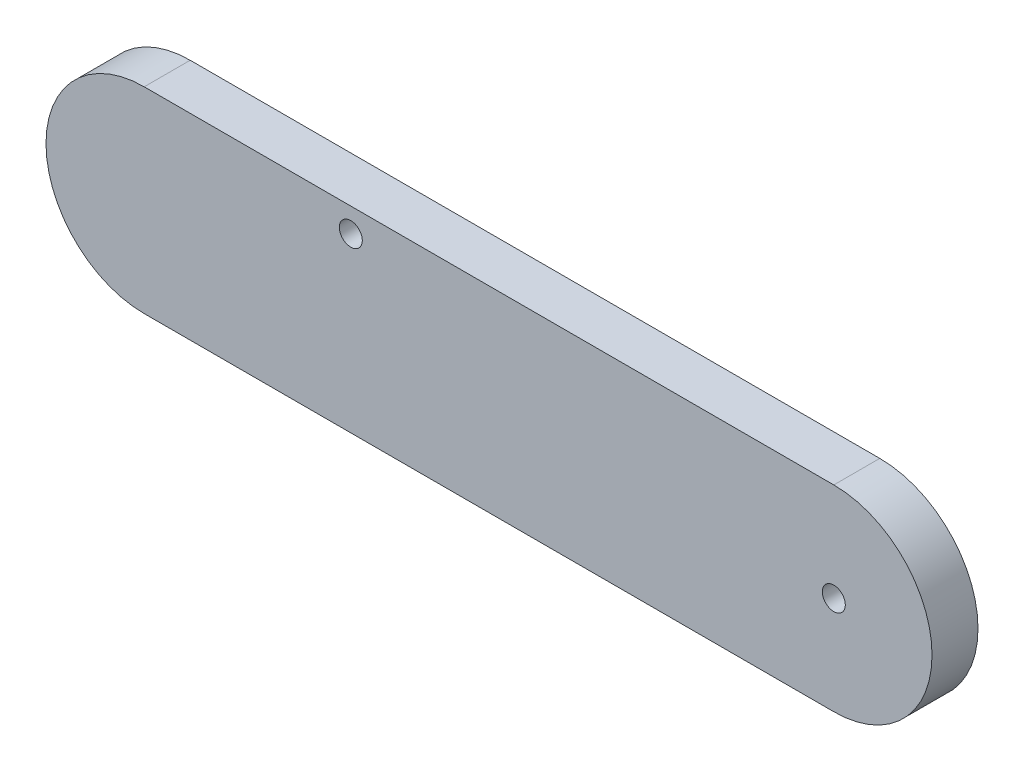
ISO-10303-21;
HEADER;
FILE_DESCRIPTION(('STEP AP214'),'2;1');
FILE_NAME('part.step','',(''),(''),'','','');
FILE_SCHEMA(('AUTOMOTIVE_DESIGN { 1 0 10303 214 1 1 1 1 }'));
ENDSEC;
DATA;
#1=APPLICATION_CONTEXT('core data for automotive mechanical design processes');
#2=APPLICATION_PROTOCOL_DEFINITION('international standard','automotive_design',2000,#1);
#3=PRODUCT_CONTEXT('',#1,'mechanical');
#4=PRODUCT('Part','Part','',(#3));
#5=PRODUCT_RELATED_PRODUCT_CATEGORY('part','',(#4));
#6=PRODUCT_DEFINITION_FORMATION('','',#4);
#7=PRODUCT_DEFINITION_CONTEXT('part definition',#1,'design');
#8=PRODUCT_DEFINITION('design','',#6,#7);
#9=PRODUCT_DEFINITION_SHAPE('','',#8);
#10=(LENGTH_UNIT() NAMED_UNIT(*) SI_UNIT(.MILLI.,.METRE.));
#11=(NAMED_UNIT(*) PLANE_ANGLE_UNIT() SI_UNIT($,.RADIAN.));
#12=(NAMED_UNIT(*) SI_UNIT($,.STERADIAN.) SOLID_ANGLE_UNIT());
#13=UNCERTAINTY_MEASURE_WITH_UNIT(LENGTH_MEASURE(1.E-05),#10,'distance_accuracy_value','');
#14=(GEOMETRIC_REPRESENTATION_CONTEXT(3) GLOBAL_UNCERTAINTY_ASSIGNED_CONTEXT((#13)) GLOBAL_UNIT_ASSIGNED_CONTEXT((#10,
#11,#12)) REPRESENTATION_CONTEXT('',''));
#15=CARTESIAN_POINT('',(0.,0.,0.));
#16=DIRECTION('',(0.,0.,1.));
#17=DIRECTION('',(1.,0.,0.));
#18=AXIS2_PLACEMENT_3D('',#15,#16,#17);
#19=CARTESIAN_POINT('',(-78.3382789317508,0.,10.));
#20=DIRECTION('',(0.,0.,1.));
#21=DIRECTION('',(1.,0.,0.));
#22=AXIS2_PLACEMENT_3D('',#19,#20,#21);
#23=PLANE('',#22);
#24=CARTESIAN_POINT('',(71.6617210682492,0.,10.));
#25=DIRECTION('',(0.,0.,1.));
#26=DIRECTION('',(1.,0.,0.));
#27=AXIS2_PLACEMENT_3D('',#24,#25,#26);
#28=CIRCLE('',#27,2.5);
#29=CARTESIAN_POINT('',(74.1617210682492,0.,10.));
#30=VERTEX_POINT('',#29);
#31=EDGE_CURVE('E113',#30,#30,#28,.T.);
#32=ORIENTED_EDGE('',*,*,#31,.F.);
#33=EDGE_LOOP('',(#32));
#34=FACE_BOUND('',#33,.T.);
#35=CARTESIAN_POINT('',(-78.3382789317508,0.,10.));
#36=DIRECTION('',(0.,0.,1.));
#37=DIRECTION('',(1.,0.,0.));
#38=AXIS2_PLACEMENT_3D('',#35,#36,#37);
#39=CIRCLE('',#38,21.3649851632047);
#40=CARTESIAN_POINT('',(-78.3382789317508,21.3649851632047,10.));
#41=VERTEX_POINT('',#40);
#42=CARTESIAN_POINT('',(-78.3382789317508,-21.3649851632047,10.));
#43=VERTEX_POINT('',#42);
#44=EDGE_CURVE('E89',#41,#43,#39,.T.);
#45=ORIENTED_EDGE('',*,*,#44,.T.);
#46=DIRECTION('',(1.,0.,0.));
#47=VECTOR('',#46,1.);
#48=CARTESIAN_POINT('',(-78.3382789317508,-21.3649851632047,10.));
#49=LINE('',#48,#47);
#50=CARTESIAN_POINT('',(71.6617210682492,-21.3649851632047,10.));
#51=VERTEX_POINT('',#50);
#52=EDGE_CURVE('E84',#43,#51,#49,.T.);
#53=ORIENTED_EDGE('',*,*,#52,.T.);
#54=CARTESIAN_POINT('',(71.6617210682492,0.,10.));
#55=DIRECTION('',(0.,0.,1.));
#56=DIRECTION('',(1.,0.,0.));
#57=AXIS2_PLACEMENT_3D('',#54,#55,#56);
#58=CIRCLE('',#57,21.3649851632047);
#59=CARTESIAN_POINT('',(71.6617210682492,21.3649851632047,10.));
#60=VERTEX_POINT('',#59);
#61=EDGE_CURVE('E87',#51,#60,#58,.T.);
#62=ORIENTED_EDGE('',*,*,#61,.T.);
#63=DIRECTION('',(-1.,0.,0.));
#64=VECTOR('',#63,1.);
#65=CARTESIAN_POINT('',(-78.3382789317508,21.3649851632047,10.));
#66=LINE('',#65,#64);
#67=EDGE_CURVE('E54',#60,#41,#66,.T.);
#68=ORIENTED_EDGE('',*,*,#67,.T.);
#69=EDGE_LOOP('',(#45,#53,#62,#68));
#70=FACE_BOUND('',#69,.T.);
#71=CARTESIAN_POINT('',(-33.4027695878032,16.1249851632047,10.));
#72=DIRECTION('',(0.,0.,1.));
#73=DIRECTION('',(1.,0.,0.));
#74=AXIS2_PLACEMENT_3D('',#71,#72,#73);
#75=CIRCLE('',#74,2.5);
#76=CARTESIAN_POINT('',(-30.9027695878032,16.1249851632047,10.));
#77=VERTEX_POINT('',#76);
#78=EDGE_CURVE('E114',#77,#77,#75,.T.);
#79=ORIENTED_EDGE('',*,*,#78,.F.);
#80=EDGE_LOOP('',(#79));
#81=FACE_BOUND('',#80,.T.);
#82=ADVANCED_FACE('F37',(#34,#70,#81),#23,.T.);
#83=CARTESIAN_POINT('',(-78.3382789317508,0.,0.));
#84=DIRECTION('',(0.,0.,1.));
#85=DIRECTION('',(1.,0.,0.));
#86=AXIS2_PLACEMENT_3D('',#83,#84,#85);
#87=PLANE('',#86);
#88=CARTESIAN_POINT('',(-78.3382789317508,0.,0.));
#89=DIRECTION('',(0.,0.,1.));
#90=DIRECTION('',(1.,0.,0.));
#91=AXIS2_PLACEMENT_3D('',#88,#89,#90);
#92=CIRCLE('',#91,21.3649851632047);
#93=CARTESIAN_POINT('',(-78.3382789317508,21.3649851632047,0.));
#94=VERTEX_POINT('',#93);
#95=CARTESIAN_POINT('',(-78.3382789317508,-21.3649851632047,0.));
#96=VERTEX_POINT('',#95);
#97=EDGE_CURVE('E118',#94,#96,#92,.T.);
#98=ORIENTED_EDGE('',*,*,#97,.F.);
#99=DIRECTION('',(-1.,0.,0.));
#100=VECTOR('',#99,1.);
#101=CARTESIAN_POINT('',(-78.3382789317508,21.3649851632047,0.));
#102=LINE('',#101,#100);
#103=CARTESIAN_POINT('',(71.6617210682492,21.3649851632047,0.));
#104=VERTEX_POINT('',#103);
#105=EDGE_CURVE('E77',#104,#94,#102,.T.);
#106=ORIENTED_EDGE('',*,*,#105,.F.);
#107=CARTESIAN_POINT('',(71.6617210682492,0.,0.));
#108=DIRECTION('',(0.,0.,1.));
#109=DIRECTION('',(1.,0.,0.));
#110=AXIS2_PLACEMENT_3D('',#107,#108,#109);
#111=CIRCLE('',#110,21.3649851632047);
#112=CARTESIAN_POINT('',(71.6617210682492,-21.3649851632047,0.));
#113=VERTEX_POINT('',#112);
#114=EDGE_CURVE('E71',#113,#104,#111,.T.);
#115=ORIENTED_EDGE('',*,*,#114,.F.);
#116=DIRECTION('',(1.,0.,0.));
#117=VECTOR('',#116,1.);
#118=CARTESIAN_POINT('',(-78.3382789317508,-21.3649851632047,0.));
#119=LINE('',#118,#117);
#120=EDGE_CURVE('E93',#96,#113,#119,.T.);
#121=ORIENTED_EDGE('',*,*,#120,.F.);
#122=EDGE_LOOP('',(#98,#106,#115,#121));
#123=FACE_BOUND('',#122,.T.);
#124=CARTESIAN_POINT('',(71.6617210682492,0.,0.));
#125=DIRECTION('',(0.,0.,1.));
#126=DIRECTION('',(1.,0.,0.));
#127=AXIS2_PLACEMENT_3D('',#124,#125,#126);
#128=CIRCLE('',#127,2.5);
#129=CARTESIAN_POINT('',(74.1617210682492,0.,0.));
#130=VERTEX_POINT('',#129);
#131=EDGE_CURVE('E111',#130,#130,#128,.T.);
#132=ORIENTED_EDGE('',*,*,#131,.T.);
#133=EDGE_LOOP('',(#132));
#134=FACE_BOUND('',#133,.T.);
#135=CARTESIAN_POINT('',(-33.4027695878032,16.1249851632047,0.));
#136=DIRECTION('',(0.,0.,1.));
#137=DIRECTION('',(1.,0.,0.));
#138=AXIS2_PLACEMENT_3D('',#135,#136,#137);
#139=CIRCLE('',#138,2.5);
#140=CARTESIAN_POINT('',(-30.9027695878032,16.1249851632047,0.));
#141=VERTEX_POINT('',#140);
#142=EDGE_CURVE('E119',#141,#141,#139,.T.);
#143=ORIENTED_EDGE('',*,*,#142,.T.);
#144=EDGE_LOOP('',(#143));
#145=FACE_BOUND('',#144,.T.);
#146=ADVANCED_FACE('F128',(#123,#134,#145),#87,.F.);
#147=CARTESIAN_POINT('',(-78.3382789317508,0.,10.));
#148=DIRECTION('',(0.,0.,-1.));
#149=DIRECTION('',(-1.,0.,0.));
#150=AXIS2_PLACEMENT_3D('',#147,#148,#149);
#151=CYLINDRICAL_SURFACE('',#150,21.3649851632047);
#152=ORIENTED_EDGE('',*,*,#97,.T.);
#153=DIRECTION('',(0.,0.,-1.));
#154=VECTOR('',#153,1.);
#155=CARTESIAN_POINT('',(-78.3382789317508,-21.3649851632047,10.));
#156=LINE('',#155,#154);
#157=EDGE_CURVE('E12',#43,#96,#156,.T.);
#158=ORIENTED_EDGE('',*,*,#157,.F.);
#159=ORIENTED_EDGE('',*,*,#44,.F.);
#160=DIRECTION('',(0.,0.,-1.));
#161=VECTOR('',#160,1.);
#162=CARTESIAN_POINT('',(-78.3382789317508,21.3649851632047,10.));
#163=LINE('',#162,#161);
#164=EDGE_CURVE('E97',#41,#94,#163,.T.);
#165=ORIENTED_EDGE('',*,*,#164,.T.);
#166=EDGE_LOOP('',(#152,#158,#159,#165));
#167=FACE_BOUND('',#166,.T.);
#168=ADVANCED_FACE('F39',(#167),#151,.T.);
#169=CARTESIAN_POINT('',(-78.3382789317508,-21.3649851632047,10.));
#170=DIRECTION('',(0.,1.,0.));
#171=DIRECTION('',(0.,0.,1.));
#172=AXIS2_PLACEMENT_3D('',#169,#170,#171);
#173=PLANE('',#172);
#174=ORIENTED_EDGE('',*,*,#120,.T.);
#175=DIRECTION('',(0.,0.,-1.));
#176=VECTOR('',#175,1.);
#177=CARTESIAN_POINT('',(71.6617210682492,-21.3649851632047,10.));
#178=LINE('',#177,#176);
#179=EDGE_CURVE('E46',#51,#113,#178,.T.);
#180=ORIENTED_EDGE('',*,*,#179,.F.);
#181=ORIENTED_EDGE('',*,*,#52,.F.);
#182=ORIENTED_EDGE('',*,*,#157,.T.);
#183=EDGE_LOOP('',(#174,#180,#181,#182));
#184=FACE_BOUND('',#183,.T.);
#185=ADVANCED_FACE('F92',(#184),#173,.F.);
#186=CARTESIAN_POINT('',(71.6617210682492,0.,10.));
#187=DIRECTION('',(0.,0.,-1.));
#188=DIRECTION('',(-1.,0.,0.));
#189=AXIS2_PLACEMENT_3D('',#186,#187,#188);
#190=CYLINDRICAL_SURFACE('',#189,21.3649851632047);
#191=ORIENTED_EDGE('',*,*,#114,.T.);
#192=DIRECTION('',(0.,0.,-1.));
#193=VECTOR('',#192,1.);
#194=CARTESIAN_POINT('',(71.6617210682492,21.3649851632047,10.));
#195=LINE('',#194,#193);
#196=EDGE_CURVE('E94',#60,#104,#195,.T.);
#197=ORIENTED_EDGE('',*,*,#196,.F.);
#198=ORIENTED_EDGE('',*,*,#61,.F.);
#199=ORIENTED_EDGE('',*,*,#179,.T.);
#200=EDGE_LOOP('',(#191,#197,#198,#199));
#201=FACE_BOUND('',#200,.T.);
#202=ADVANCED_FACE('F95',(#201),#190,.T.);
#203=CARTESIAN_POINT('',(-78.3382789317508,21.3649851632047,10.));
#204=DIRECTION('',(0.,-1.,0.));
#205=DIRECTION('',(0.,0.,-1.));
#206=AXIS2_PLACEMENT_3D('',#203,#204,#205);
#207=PLANE('',#206);
#208=ORIENTED_EDGE('',*,*,#105,.T.);
#209=ORIENTED_EDGE('',*,*,#164,.F.);
#210=ORIENTED_EDGE('',*,*,#67,.F.);
#211=ORIENTED_EDGE('',*,*,#196,.T.);
#212=EDGE_LOOP('',(#208,#209,#210,#211));
#213=FACE_BOUND('',#212,.T.);
#214=ADVANCED_FACE('F141',(#213),#207,.F.);
#215=CARTESIAN_POINT('',(71.6617210682492,0.,10.));
#216=DIRECTION('',(0.,0.,-1.));
#217=DIRECTION('',(-1.,0.,0.));
#218=AXIS2_PLACEMENT_3D('',#215,#216,#217);
#219=CYLINDRICAL_SURFACE('',#218,2.5);
#220=ORIENTED_EDGE('',*,*,#31,.T.);
#221=EDGE_LOOP('',(#220));
#222=FACE_BOUND('',#221,.T.);
#223=ORIENTED_EDGE('',*,*,#131,.F.);
#224=EDGE_LOOP('',(#223));
#225=FACE_BOUND('',#224,.T.);
#226=ADVANCED_FACE('F138',(#222,#225),#219,.F.);
#227=CARTESIAN_POINT('',(-33.4027695878032,16.1249851632047,10.));
#228=DIRECTION('',(0.,0.,-1.));
#229=DIRECTION('',(-1.,0.,0.));
#230=AXIS2_PLACEMENT_3D('',#227,#228,#229);
#231=CYLINDRICAL_SURFACE('',#230,2.5);
#232=ORIENTED_EDGE('',*,*,#78,.T.);
#233=EDGE_LOOP('',(#232));
#234=FACE_BOUND('',#233,.T.);
#235=ORIENTED_EDGE('',*,*,#142,.F.);
#236=EDGE_LOOP('',(#235));
#237=FACE_BOUND('',#236,.T.);
#238=ADVANCED_FACE('F125',(#234,#237),#231,.F.);
#239=CLOSED_SHELL('',(#82,#146,#168,#185,#202,#214,#226,#238));
#240=MANIFOLD_SOLID_BREP('B2',#239);
#241=ADVANCED_BREP_SHAPE_REPRESENTATION('',(#18,#240),#14);
#242=SHAPE_DEFINITION_REPRESENTATION(#9,#241);
ENDSEC;
END-ISO-10303-21;
